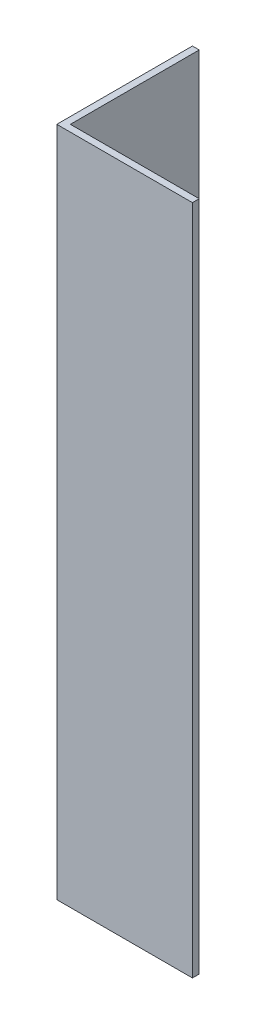
ISO-10303-21;
HEADER;
FILE_DESCRIPTION(('STEP AP214'),'2;1');
FILE_NAME('part.step','',(''),(''),'','','');
FILE_SCHEMA(('AUTOMOTIVE_DESIGN { 1 0 10303 214 1 1 1 1 }'));
ENDSEC;
DATA;
#1=APPLICATION_CONTEXT('core data for automotive mechanical design processes');
#2=APPLICATION_PROTOCOL_DEFINITION('international standard','automotive_design',2000,#1);
#3=PRODUCT_CONTEXT('',#1,'mechanical');
#4=PRODUCT('Part','Part','',(#3));
#5=PRODUCT_RELATED_PRODUCT_CATEGORY('part','',(#4));
#6=PRODUCT_DEFINITION_FORMATION('','',#4);
#7=PRODUCT_DEFINITION_CONTEXT('part definition',#1,'design');
#8=PRODUCT_DEFINITION('design','',#6,#7);
#9=PRODUCT_DEFINITION_SHAPE('','',#8);
#10=(LENGTH_UNIT() NAMED_UNIT(*) SI_UNIT(.MILLI.,.METRE.));
#11=(NAMED_UNIT(*) PLANE_ANGLE_UNIT() SI_UNIT($,.RADIAN.));
#12=(NAMED_UNIT(*) SI_UNIT($,.STERADIAN.) SOLID_ANGLE_UNIT());
#13=UNCERTAINTY_MEASURE_WITH_UNIT(LENGTH_MEASURE(1.E-05),#10,'distance_accuracy_value','');
#14=(GEOMETRIC_REPRESENTATION_CONTEXT(3) GLOBAL_UNCERTAINTY_ASSIGNED_CONTEXT((#13)) GLOBAL_UNIT_ASSIGNED_CONTEXT((#10,
#11,#12)) REPRESENTATION_CONTEXT('',''));
#15=CARTESIAN_POINT('',(0.,0.,0.));
#16=DIRECTION('',(0.,0.,1.));
#17=DIRECTION('',(1.,0.,0.));
#18=AXIS2_PLACEMENT_3D('',#15,#16,#17);
#19=CARTESIAN_POINT('',(20.,99.,0.));
#20=DIRECTION('',(0.,0.,-1.));
#21=DIRECTION('',(-1.,0.,0.));
#22=AXIS2_PLACEMENT_3D('',#19,#20,#21);
#23=PLANE('',#22);
#24=DIRECTION('',(1.,0.,0.));
#25=VECTOR('',#24,1.);
#26=CARTESIAN_POINT('',(20.,0.,0.));
#27=LINE('',#26,#25);
#28=CARTESIAN_POINT('',(0.,0.,0.));
#29=VERTEX_POINT('',#28);
#30=CARTESIAN_POINT('',(20.,0.,0.));
#31=VERTEX_POINT('',#30);
#32=EDGE_CURVE('E119',#29,#31,#27,.T.);
#33=ORIENTED_EDGE('',*,*,#32,.T.);
#34=DIRECTION('',(0.,-1.,0.));
#35=VECTOR('',#34,1.);
#36=CARTESIAN_POINT('',(20.,99.,0.));
#37=LINE('',#36,#35);
#38=CARTESIAN_POINT('',(20.,99.,0.));
#39=VERTEX_POINT('',#38);
#40=EDGE_CURVE('E11',#39,#31,#37,.T.);
#41=ORIENTED_EDGE('',*,*,#40,.F.);
#42=DIRECTION('',(1.,0.,0.));
#43=VECTOR('',#42,1.);
#44=CARTESIAN_POINT('',(20.,99.,0.));
#45=LINE('',#44,#43);
#46=CARTESIAN_POINT('',(0.,99.,0.));
#47=VERTEX_POINT('',#46);
#48=EDGE_CURVE('E129',#47,#39,#45,.T.);
#49=ORIENTED_EDGE('',*,*,#48,.F.);
#50=DIRECTION('',(0.,-1.,0.));
#51=VECTOR('',#50,1.);
#52=CARTESIAN_POINT('',(0.,99.,0.));
#53=LINE('',#52,#51);
#54=EDGE_CURVE('E115',#47,#29,#53,.T.);
#55=ORIENTED_EDGE('',*,*,#54,.T.);
#56=EDGE_LOOP('',(#33,#41,#49,#55));
#57=FACE_BOUND('',#56,.T.);
#58=ADVANCED_FACE('F35',(#57),#23,.F.);
#59=CARTESIAN_POINT('',(20.,99.,-0.999999999999998));
#60=DIRECTION('',(-1.,0.,0.));
#61=DIRECTION('',(0.,0.,1.));
#62=AXIS2_PLACEMENT_3D('',#59,#60,#61);
#63=PLANE('',#62);
#64=DIRECTION('',(0.,0.,-1.));
#65=VECTOR('',#64,1.);
#66=CARTESIAN_POINT('',(20.,0.,-0.999999999999998));
#67=LINE('',#66,#65);
#68=CARTESIAN_POINT('',(20.,0.,-0.999999999999998));
#69=VERTEX_POINT('',#68);
#70=EDGE_CURVE('E122',#31,#69,#67,.T.);
#71=ORIENTED_EDGE('',*,*,#70,.T.);
#72=DIRECTION('',(0.,-1.,0.));
#73=VECTOR('',#72,1.);
#74=CARTESIAN_POINT('',(20.,99.,-0.999999999999998));
#75=LINE('',#74,#73);
#76=CARTESIAN_POINT('',(20.,99.,-0.999999999999998));
#77=VERTEX_POINT('',#76);
#78=EDGE_CURVE('E43',#77,#69,#75,.T.);
#79=ORIENTED_EDGE('',*,*,#78,.F.);
#80=DIRECTION('',(0.,0.,-1.));
#81=VECTOR('',#80,1.);
#82=CARTESIAN_POINT('',(20.,99.,-0.999999999999998));
#83=LINE('',#82,#81);
#84=EDGE_CURVE('E88',#39,#77,#83,.T.);
#85=ORIENTED_EDGE('',*,*,#84,.F.);
#86=ORIENTED_EDGE('',*,*,#40,.T.);
#87=EDGE_LOOP('',(#71,#79,#85,#86));
#88=FACE_BOUND('',#87,.T.);
#89=ADVANCED_FACE('F153',(#88),#63,.F.);
#90=CARTESIAN_POINT('',(1.,99.,-0.999999999999997));
#91=DIRECTION('',(0.,0.,1.));
#92=DIRECTION('',(1.,0.,0.));
#93=AXIS2_PLACEMENT_3D('',#90,#91,#92);
#94=PLANE('',#93);
#95=DIRECTION('',(-1.,0.,0.));
#96=VECTOR('',#95,1.);
#97=CARTESIAN_POINT('',(1.,0.,-0.999999999999997));
#98=LINE('',#97,#96);
#99=CARTESIAN_POINT('',(1.,0.,-0.999999999999997));
#100=VERTEX_POINT('',#99);
#101=EDGE_CURVE('E124',#69,#100,#98,.T.);
#102=ORIENTED_EDGE('',*,*,#101,.T.);
#103=DIRECTION('',(0.,-1.,0.));
#104=VECTOR('',#103,1.);
#105=CARTESIAN_POINT('',(1.,99.,-0.999999999999997));
#106=LINE('',#105,#104);
#107=CARTESIAN_POINT('',(1.,99.,-0.999999999999997));
#108=VERTEX_POINT('',#107);
#109=EDGE_CURVE('E110',#108,#100,#106,.T.);
#110=ORIENTED_EDGE('',*,*,#109,.F.);
#111=DIRECTION('',(-1.,0.,0.));
#112=VECTOR('',#111,1.);
#113=CARTESIAN_POINT('',(1.,99.,-0.999999999999997));
#114=LINE('',#113,#112);
#115=EDGE_CURVE('E101',#77,#108,#114,.T.);
#116=ORIENTED_EDGE('',*,*,#115,.F.);
#117=ORIENTED_EDGE('',*,*,#78,.T.);
#118=EDGE_LOOP('',(#102,#110,#116,#117));
#119=FACE_BOUND('',#118,.T.);
#120=ADVANCED_FACE('F135',(#119),#94,.F.);
#121=CARTESIAN_POINT('',(0.999999999999998,99.,-20.));
#122=DIRECTION('',(-1.,0.,0.));
#123=DIRECTION('',(0.,0.,1.));
#124=AXIS2_PLACEMENT_3D('',#121,#122,#123);
#125=PLANE('',#124);
#126=DIRECTION('',(0.,0.,-1.));
#127=VECTOR('',#126,1.);
#128=CARTESIAN_POINT('',(0.999999999999998,0.,-20.));
#129=LINE('',#128,#127);
#130=CARTESIAN_POINT('',(0.999999999999998,0.,-20.));
#131=VERTEX_POINT('',#130);
#132=EDGE_CURVE('E109',#100,#131,#129,.T.);
#133=ORIENTED_EDGE('',*,*,#132,.T.);
#134=DIRECTION('',(0.,-1.,0.));
#135=VECTOR('',#134,1.);
#136=CARTESIAN_POINT('',(0.999999999999998,99.,-20.));
#137=LINE('',#136,#135);
#138=CARTESIAN_POINT('',(0.999999999999998,99.,-20.));
#139=VERTEX_POINT('',#138);
#140=EDGE_CURVE('E106',#139,#131,#137,.T.);
#141=ORIENTED_EDGE('',*,*,#140,.F.);
#142=DIRECTION('',(0.,0.,-1.));
#143=VECTOR('',#142,1.);
#144=CARTESIAN_POINT('',(0.999999999999998,99.,-20.));
#145=LINE('',#144,#143);
#146=EDGE_CURVE('E95',#108,#139,#145,.T.);
#147=ORIENTED_EDGE('',*,*,#146,.F.);
#148=ORIENTED_EDGE('',*,*,#109,.T.);
#149=EDGE_LOOP('',(#133,#141,#147,#148));
#150=FACE_BOUND('',#149,.T.);
#151=ADVANCED_FACE('F107',(#150),#125,.F.);
#152=CARTESIAN_POINT('',(0.,99.,-20.));
#153=DIRECTION('',(0.,0.,1.));
#154=DIRECTION('',(1.,0.,0.));
#155=AXIS2_PLACEMENT_3D('',#152,#153,#154);
#156=PLANE('',#155);
#157=DIRECTION('',(-1.,0.,0.));
#158=VECTOR('',#157,1.);
#159=CARTESIAN_POINT('',(0.,0.,-20.));
#160=LINE('',#159,#158);
#161=CARTESIAN_POINT('',(0.,0.,-20.));
#162=VERTEX_POINT('',#161);
#163=EDGE_CURVE('E74',#131,#162,#160,.T.);
#164=ORIENTED_EDGE('',*,*,#163,.T.);
#165=DIRECTION('',(0.,-1.,0.));
#166=VECTOR('',#165,1.);
#167=CARTESIAN_POINT('',(0.,99.,-20.));
#168=LINE('',#167,#166);
#169=CARTESIAN_POINT('',(0.,99.,-20.));
#170=VERTEX_POINT('',#169);
#171=EDGE_CURVE('E111',#170,#162,#168,.T.);
#172=ORIENTED_EDGE('',*,*,#171,.F.);
#173=DIRECTION('',(-1.,0.,0.));
#174=VECTOR('',#173,1.);
#175=CARTESIAN_POINT('',(0.,99.,-20.));
#176=LINE('',#175,#174);
#177=EDGE_CURVE('E99',#139,#170,#176,.T.);
#178=ORIENTED_EDGE('',*,*,#177,.F.);
#179=ORIENTED_EDGE('',*,*,#140,.T.);
#180=EDGE_LOOP('',(#164,#172,#178,#179));
#181=FACE_BOUND('',#180,.T.);
#182=ADVANCED_FACE('F113',(#181),#156,.F.);
#183=CARTESIAN_POINT('',(0.,99.,0.));
#184=DIRECTION('',(1.,0.,0.));
#185=DIRECTION('',(0.,0.,-1.));
#186=AXIS2_PLACEMENT_3D('',#183,#184,#185);
#187=PLANE('',#186);
#188=DIRECTION('',(0.,0.,1.));
#189=VECTOR('',#188,1.);
#190=CARTESIAN_POINT('',(0.,0.,0.));
#191=LINE('',#190,#189);
#192=EDGE_CURVE('E80',#162,#29,#191,.T.);
#193=ORIENTED_EDGE('',*,*,#192,.T.);
#194=ORIENTED_EDGE('',*,*,#54,.F.);
#195=DIRECTION('',(0.,0.,1.));
#196=VECTOR('',#195,1.);
#197=CARTESIAN_POINT('',(0.,99.,0.));
#198=LINE('',#197,#196);
#199=EDGE_CURVE('E51',#170,#47,#198,.T.);
#200=ORIENTED_EDGE('',*,*,#199,.F.);
#201=ORIENTED_EDGE('',*,*,#171,.T.);
#202=EDGE_LOOP('',(#193,#194,#200,#201));
#203=FACE_BOUND('',#202,.T.);
#204=ADVANCED_FACE('F142',(#203),#187,.F.);
#205=CARTESIAN_POINT('',(0.,99.,0.));
#206=DIRECTION('',(0.,-1.,0.));
#207=DIRECTION('',(0.,0.,-1.));
#208=AXIS2_PLACEMENT_3D('',#205,#206,#207);
#209=PLANE('',#208);
#210=ORIENTED_EDGE('',*,*,#48,.T.);
#211=ORIENTED_EDGE('',*,*,#84,.T.);
#212=ORIENTED_EDGE('',*,*,#115,.T.);
#213=ORIENTED_EDGE('',*,*,#146,.T.);
#214=ORIENTED_EDGE('',*,*,#177,.T.);
#215=ORIENTED_EDGE('',*,*,#199,.T.);
#216=EDGE_LOOP('',(#210,#211,#212,#213,#214,#215));
#217=FACE_BOUND('',#216,.T.);
#218=ADVANCED_FACE('F97',(#217),#209,.F.);
#219=CARTESIAN_POINT('',(0.,0.,0.));
#220=DIRECTION('',(0.,-1.,0.));
#221=DIRECTION('',(0.,0.,-1.));
#222=AXIS2_PLACEMENT_3D('',#219,#220,#221);
#223=PLANE('',#222);
#224=ORIENTED_EDGE('',*,*,#32,.F.);
#225=ORIENTED_EDGE('',*,*,#192,.F.);
#226=ORIENTED_EDGE('',*,*,#163,.F.);
#227=ORIENTED_EDGE('',*,*,#132,.F.);
#228=ORIENTED_EDGE('',*,*,#101,.F.);
#229=ORIENTED_EDGE('',*,*,#70,.F.);
#230=EDGE_LOOP('',(#224,#225,#226,#227,#228,#229));
#231=FACE_BOUND('',#230,.T.);
#232=ADVANCED_FACE('F138',(#231),#223,.T.);
#233=CLOSED_SHELL('',(#58,#89,#120,#151,#182,#204,#218,#232));
#234=MANIFOLD_SOLID_BREP('B2',#233);
#235=ADVANCED_BREP_SHAPE_REPRESENTATION('',(#18,#234),#14);
#236=SHAPE_DEFINITION_REPRESENTATION(#9,#235);
ENDSEC;
END-ISO-10303-21;
